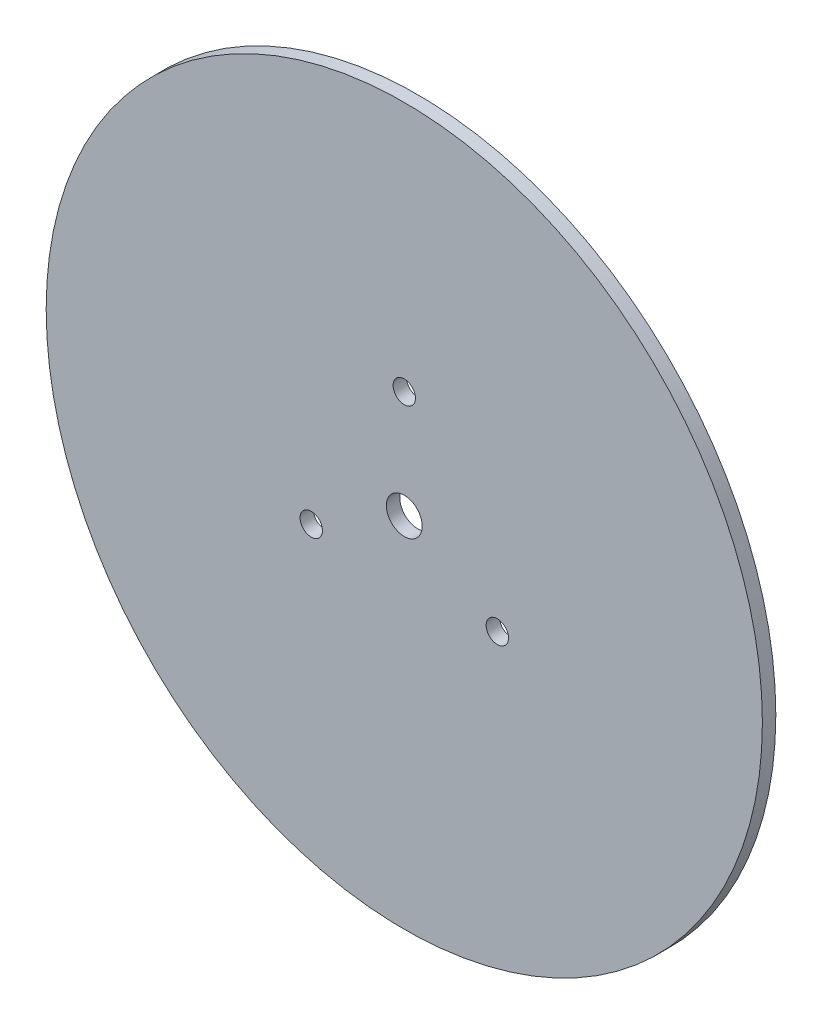
ISO-10303-21;
HEADER;
FILE_DESCRIPTION(('STEP AP214'),'2;1');
FILE_NAME('part.step','',(''),(''),'','','');
FILE_SCHEMA(('AUTOMOTIVE_DESIGN { 1 0 10303 214 1 1 1 1 }'));
ENDSEC;
DATA;
#1=APPLICATION_CONTEXT('core data for automotive mechanical design processes');
#2=APPLICATION_PROTOCOL_DEFINITION('international standard','automotive_design',2000,#1);
#3=PRODUCT_CONTEXT('',#1,'mechanical');
#4=PRODUCT('Part','Part','',(#3));
#5=PRODUCT_RELATED_PRODUCT_CATEGORY('part','',(#4));
#6=PRODUCT_DEFINITION_FORMATION('','',#4);
#7=PRODUCT_DEFINITION_CONTEXT('part definition',#1,'design');
#8=PRODUCT_DEFINITION('design','',#6,#7);
#9=PRODUCT_DEFINITION_SHAPE('','',#8);
#10=(LENGTH_UNIT() NAMED_UNIT(*) SI_UNIT(.MILLI.,.METRE.));
#11=(NAMED_UNIT(*) PLANE_ANGLE_UNIT() SI_UNIT($,.RADIAN.));
#12=(NAMED_UNIT(*) SI_UNIT($,.STERADIAN.) SOLID_ANGLE_UNIT());
#13=UNCERTAINTY_MEASURE_WITH_UNIT(LENGTH_MEASURE(1.E-05),#10,'distance_accuracy_value','');
#14=(GEOMETRIC_REPRESENTATION_CONTEXT(3) GLOBAL_UNCERTAINTY_ASSIGNED_CONTEXT((#13)) GLOBAL_UNIT_ASSIGNED_CONTEXT((#10,
#11,#12)) REPRESENTATION_CONTEXT('',''));
#15=CARTESIAN_POINT('',(0.,0.,0.));
#16=DIRECTION('',(0.,0.,1.));
#17=DIRECTION('',(1.,0.,0.));
#18=AXIS2_PLACEMENT_3D('',#15,#16,#17);
#19=CARTESIAN_POINT('',(0.,0.,3.));
#20=DIRECTION('',(0.,0.,-1.));
#21=DIRECTION('',(-1.,0.,0.));
#22=AXIS2_PLACEMENT_3D('',#19,#20,#21);
#23=CYLINDRICAL_SURFACE('',#22,4.);
#24=CARTESIAN_POINT('',(0.,0.,3.));
#25=DIRECTION('',(0.,0.,1.));
#26=DIRECTION('',(1.,0.,0.));
#27=AXIS2_PLACEMENT_3D('',#24,#25,#26);
#28=CIRCLE('',#27,4.);
#29=CARTESIAN_POINT('',(4.,0.,3.));
#30=VERTEX_POINT('',#29);
#31=EDGE_CURVE('E46',#30,#30,#28,.T.);
#32=ORIENTED_EDGE('',*,*,#31,.T.);
#33=EDGE_LOOP('',(#32));
#34=FACE_BOUND('',#33,.T.);
#35=CARTESIAN_POINT('',(0.,0.,0.));
#36=DIRECTION('',(0.,0.,1.));
#37=DIRECTION('',(1.,0.,0.));
#38=AXIS2_PLACEMENT_3D('',#35,#36,#37);
#39=CIRCLE('',#38,4.);
#40=CARTESIAN_POINT('',(4.,0.,0.));
#41=VERTEX_POINT('',#40);
#42=EDGE_CURVE('E55',#41,#41,#39,.T.);
#43=ORIENTED_EDGE('',*,*,#42,.F.);
#44=EDGE_LOOP('',(#43));
#45=FACE_BOUND('',#44,.T.);
#46=ADVANCED_FACE('F38',(#34,#45),#23,.F.);
#47=CARTESIAN_POINT('',(0.,0.,3.));
#48=DIRECTION('',(0.,0.,-1.));
#49=DIRECTION('',(-1.,0.,0.));
#50=AXIS2_PLACEMENT_3D('',#47,#48,#49);
#51=CYLINDRICAL_SURFACE('',#50,80.);
#52=CARTESIAN_POINT('',(0.,0.,3.));
#53=DIRECTION('',(0.,0.,1.));
#54=DIRECTION('',(1.,0.,0.));
#55=AXIS2_PLACEMENT_3D('',#52,#53,#54);
#56=CIRCLE('',#55,80.);
#57=CARTESIAN_POINT('',(80.,0.,3.));
#58=VERTEX_POINT('',#57);
#59=EDGE_CURVE('E11',#58,#58,#56,.T.);
#60=ORIENTED_EDGE('',*,*,#59,.F.);
#61=EDGE_LOOP('',(#60));
#62=FACE_BOUND('',#61,.T.);
#63=CARTESIAN_POINT('',(0.,0.,0.));
#64=DIRECTION('',(0.,0.,1.));
#65=DIRECTION('',(1.,0.,0.));
#66=AXIS2_PLACEMENT_3D('',#63,#64,#65);
#67=CIRCLE('',#66,80.);
#68=CARTESIAN_POINT('',(80.,0.,0.));
#69=VERTEX_POINT('',#68);
#70=EDGE_CURVE('E51',#69,#69,#67,.T.);
#71=ORIENTED_EDGE('',*,*,#70,.T.);
#72=EDGE_LOOP('',(#71));
#73=FACE_BOUND('',#72,.T.);
#74=ADVANCED_FACE('F94',(#62,#73),#51,.T.);
#75=CARTESIAN_POINT('',(0.,0.,3.));
#76=DIRECTION('',(0.,0.,1.));
#77=DIRECTION('',(1.,0.,0.));
#78=AXIS2_PLACEMENT_3D('',#75,#76,#77);
#79=PLANE('',#78);
#80=CARTESIAN_POINT('',(0.,24.,3.));
#81=DIRECTION('',(0.,0.,1.));
#82=DIRECTION('',(1.,0.,0.));
#83=AXIS2_PLACEMENT_3D('',#80,#81,#82);
#84=CIRCLE('',#83,2.5);
#85=CARTESIAN_POINT('',(2.5,24.,3.));
#86=VERTEX_POINT('',#85);
#87=EDGE_CURVE('E69',#86,#86,#84,.T.);
#88=ORIENTED_EDGE('',*,*,#87,.F.);
#89=EDGE_LOOP('',(#88));
#90=FACE_BOUND('',#89,.T.);
#91=CARTESIAN_POINT('',(20.7846096908281,-11.9999999999991,3.));
#92=DIRECTION('',(0.,0.,1.));
#93=DIRECTION('',(1.,0.,0.));
#94=AXIS2_PLACEMENT_3D('',#91,#92,#93);
#95=CIRCLE('',#94,2.50000000000132);
#96=CARTESIAN_POINT('',(23.2846096908294,-11.9999999999991,3.));
#97=VERTEX_POINT('',#96);
#98=EDGE_CURVE('E127',#97,#97,#95,.T.);
#99=ORIENTED_EDGE('',*,*,#98,.F.);
#100=EDGE_LOOP('',(#99));
#101=FACE_BOUND('',#100,.T.);
#102=CARTESIAN_POINT('',(-20.784609690825,-12.0000000000009,3.));
#103=DIRECTION('',(0.,0.,1.));
#104=DIRECTION('',(1.,0.,0.));
#105=AXIS2_PLACEMENT_3D('',#102,#103,#104);
#106=CIRCLE('',#105,2.50000000000194);
#107=CARTESIAN_POINT('',(-18.2846096908231,-12.0000000000009,3.));
#108=VERTEX_POINT('',#107);
#109=EDGE_CURVE('E131',#108,#108,#106,.T.);
#110=ORIENTED_EDGE('',*,*,#109,.F.);
#111=EDGE_LOOP('',(#110));
#112=FACE_BOUND('',#111,.T.);
#113=ORIENTED_EDGE('',*,*,#31,.F.);
#114=EDGE_LOOP('',(#113));
#115=FACE_BOUND('',#114,.T.);
#116=ORIENTED_EDGE('',*,*,#59,.T.);
#117=EDGE_LOOP('',(#116));
#118=FACE_BOUND('',#117,.T.);
#119=ADVANCED_FACE('F99',(#90,#101,#112,#115,#118),#79,.T.);
#120=CARTESIAN_POINT('',(0.,0.,0.));
#121=DIRECTION('',(0.,0.,1.));
#122=DIRECTION('',(1.,0.,0.));
#123=AXIS2_PLACEMENT_3D('',#120,#121,#122);
#124=PLANE('',#123);
#125=CARTESIAN_POINT('',(0.,24.,0.));
#126=DIRECTION('',(0.,0.,1.));
#127=DIRECTION('',(1.,0.,0.));
#128=AXIS2_PLACEMENT_3D('',#125,#126,#127);
#129=CIRCLE('',#128,2.5);
#130=CARTESIAN_POINT('',(2.5,24.,0.));
#131=VERTEX_POINT('',#130);
#132=EDGE_CURVE('E41',#131,#131,#129,.T.);
#133=ORIENTED_EDGE('',*,*,#132,.T.);
#134=EDGE_LOOP('',(#133));
#135=FACE_BOUND('',#134,.T.);
#136=CARTESIAN_POINT('',(20.7846096908281,-11.9999999999991,0.));
#137=DIRECTION('',(0.,0.,1.));
#138=DIRECTION('',(1.,0.,0.));
#139=AXIS2_PLACEMENT_3D('',#136,#137,#138);
#140=CIRCLE('',#139,2.50000000000132);
#141=CARTESIAN_POINT('',(23.2846096908294,-11.9999999999991,0.));
#142=VERTEX_POINT('',#141);
#143=EDGE_CURVE('E68',#142,#142,#140,.T.);
#144=ORIENTED_EDGE('',*,*,#143,.T.);
#145=EDGE_LOOP('',(#144));
#146=FACE_BOUND('',#145,.T.);
#147=CARTESIAN_POINT('',(-20.784609690825,-12.0000000000009,0.));
#148=DIRECTION('',(0.,0.,1.));
#149=DIRECTION('',(1.,0.,0.));
#150=AXIS2_PLACEMENT_3D('',#147,#148,#149);
#151=CIRCLE('',#150,2.50000000000194);
#152=CARTESIAN_POINT('',(-18.2846096908231,-12.0000000000009,0.));
#153=VERTEX_POINT('',#152);
#154=EDGE_CURVE('E64',#153,#153,#151,.T.);
#155=ORIENTED_EDGE('',*,*,#154,.T.);
#156=EDGE_LOOP('',(#155));
#157=FACE_BOUND('',#156,.T.);
#158=ORIENTED_EDGE('',*,*,#42,.T.);
#159=EDGE_LOOP('',(#158));
#160=FACE_BOUND('',#159,.T.);
#161=ORIENTED_EDGE('',*,*,#70,.F.);
#162=EDGE_LOOP('',(#161));
#163=FACE_BOUND('',#162,.T.);
#164=ADVANCED_FACE('F79',(#135,#146,#157,#160,#163),#124,.F.);
#165=CARTESIAN_POINT('',(-20.784609690825,-12.0000000000009,-7.));
#166=DIRECTION('',(0.,0.,1.));
#167=DIRECTION('',(1.,0.,0.));
#168=AXIS2_PLACEMENT_3D('',#165,#166,#167);
#169=CYLINDRICAL_SURFACE('',#168,2.50000000000194);
#170=ORIENTED_EDGE('',*,*,#109,.T.);
#171=EDGE_LOOP('',(#170));
#172=FACE_BOUND('',#171,.T.);
#173=ORIENTED_EDGE('',*,*,#154,.F.);
#174=EDGE_LOOP('',(#173));
#175=FACE_BOUND('',#174,.T.);
#176=ADVANCED_FACE('F89',(#172,#175),#169,.F.);
#177=CARTESIAN_POINT('',(20.7846096908281,-11.9999999999991,-7.));
#178=DIRECTION('',(0.,0.,1.));
#179=DIRECTION('',(1.,0.,0.));
#180=AXIS2_PLACEMENT_3D('',#177,#178,#179);
#181=CYLINDRICAL_SURFACE('',#180,2.50000000000132);
#182=ORIENTED_EDGE('',*,*,#98,.T.);
#183=EDGE_LOOP('',(#182));
#184=FACE_BOUND('',#183,.T.);
#185=ORIENTED_EDGE('',*,*,#143,.F.);
#186=EDGE_LOOP('',(#185));
#187=FACE_BOUND('',#186,.T.);
#188=ADVANCED_FACE('F83',(#184,#187),#181,.F.);
#189=CARTESIAN_POINT('',(0.,24.,-7.));
#190=DIRECTION('',(0.,0.,1.));
#191=DIRECTION('',(1.,0.,0.));
#192=AXIS2_PLACEMENT_3D('',#189,#190,#191);
#193=CYLINDRICAL_SURFACE('',#192,2.5);
#194=ORIENTED_EDGE('',*,*,#87,.T.);
#195=EDGE_LOOP('',(#194));
#196=FACE_BOUND('',#195,.T.);
#197=ORIENTED_EDGE('',*,*,#132,.F.);
#198=EDGE_LOOP('',(#197));
#199=FACE_BOUND('',#198,.T.);
#200=ADVANCED_FACE('F81',(#196,#199),#193,.F.);
#201=CLOSED_SHELL('',(#46,#74,#119,#164,#176,#188,#200));
#202=MANIFOLD_SOLID_BREP('B2',#201);
#203=ADVANCED_BREP_SHAPE_REPRESENTATION('',(#18,#202),#14);
#204=SHAPE_DEFINITION_REPRESENTATION(#9,#203);
ENDSEC;
END-ISO-10303-21;
